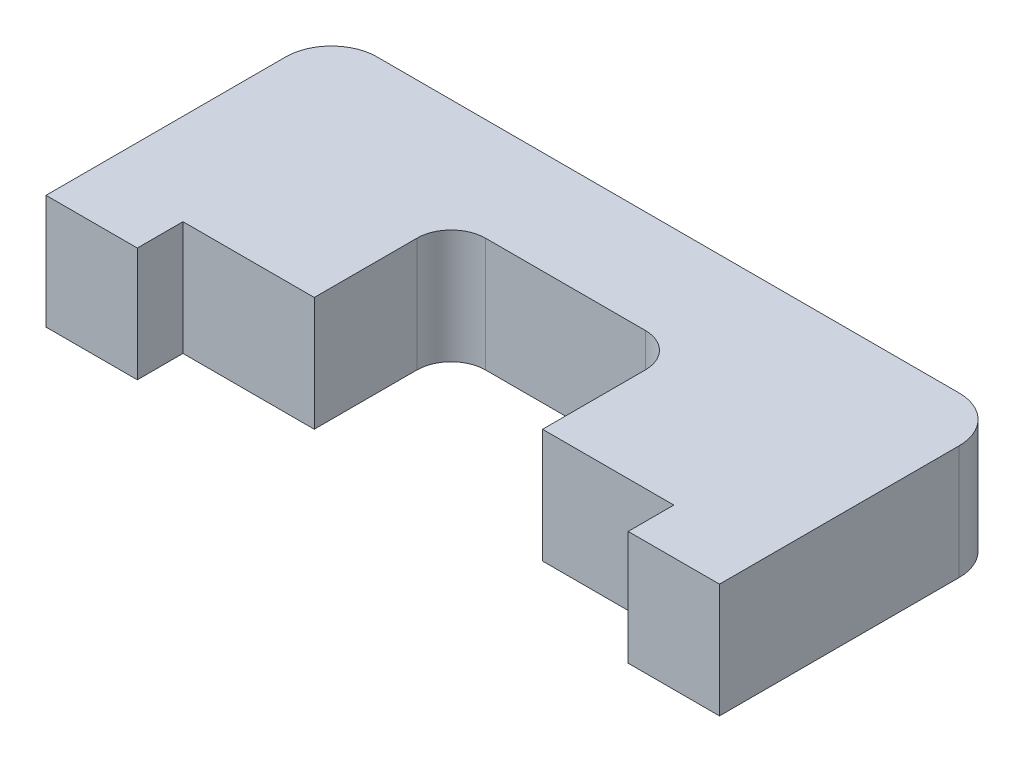
ISO-10303-21;
HEADER;
FILE_DESCRIPTION(('STEP AP214'),'2;1');
FILE_NAME('part.step','',(''),(''),'','','');
FILE_SCHEMA(('AUTOMOTIVE_DESIGN { 1 0 10303 214 1 1 1 1 }'));
ENDSEC;
DATA;
#1=APPLICATION_CONTEXT('core data for automotive mechanical design processes');
#2=APPLICATION_PROTOCOL_DEFINITION('international standard','automotive_design',2000,#1);
#3=PRODUCT_CONTEXT('',#1,'mechanical');
#4=PRODUCT('Part','Part','',(#3));
#5=PRODUCT_RELATED_PRODUCT_CATEGORY('part','',(#4));
#6=PRODUCT_DEFINITION_FORMATION('','',#4);
#7=PRODUCT_DEFINITION_CONTEXT('part definition',#1,'design');
#8=PRODUCT_DEFINITION('design','',#6,#7);
#9=PRODUCT_DEFINITION_SHAPE('','',#8);
#10=(LENGTH_UNIT() NAMED_UNIT(*) SI_UNIT(.MILLI.,.METRE.));
#11=(NAMED_UNIT(*) PLANE_ANGLE_UNIT() SI_UNIT($,.RADIAN.));
#12=(NAMED_UNIT(*) SI_UNIT($,.STERADIAN.) SOLID_ANGLE_UNIT());
#13=UNCERTAINTY_MEASURE_WITH_UNIT(LENGTH_MEASURE(1.E-05),#10,'distance_accuracy_value','');
#14=(GEOMETRIC_REPRESENTATION_CONTEXT(3) GLOBAL_UNCERTAINTY_ASSIGNED_CONTEXT((#13)) GLOBAL_UNIT_ASSIGNED_CONTEXT((#10,
#11,#12)) REPRESENTATION_CONTEXT('',''));
#15=CARTESIAN_POINT('',(0.,0.,0.));
#16=DIRECTION('',(0.,0.,1.));
#17=DIRECTION('',(1.,0.,0.));
#18=AXIS2_PLACEMENT_3D('',#15,#16,#17);
#19=CARTESIAN_POINT('',(14.75,5.,6.25));
#20=DIRECTION('',(0.,0.,-1.));
#21=DIRECTION('',(-1.,0.,0.));
#22=AXIS2_PLACEMENT_3D('',#19,#20,#21);
#23=PLANE('',#22);
#24=DIRECTION('',(1.,0.,0.));
#25=VECTOR('',#24,1.);
#26=CARTESIAN_POINT('',(14.75,0.,6.25));
#27=LINE('',#26,#25);
#28=CARTESIAN_POINT('',(-14.75,0.,6.25));
#29=VERTEX_POINT('',#28);
#30=CARTESIAN_POINT('',(-10.75,0.,6.25));
#31=VERTEX_POINT('',#30);
#32=EDGE_CURVE('E232',#29,#31,#27,.T.);
#33=ORIENTED_EDGE('',*,*,#32,.T.);
#34=DIRECTION('',(0.,-1.,0.));
#35=VECTOR('',#34,1.);
#36=CARTESIAN_POINT('',(-10.75,5.,6.25));
#37=LINE('',#36,#35);
#38=CARTESIAN_POINT('',(-10.75,5.,6.25));
#39=VERTEX_POINT('',#38);
#40=EDGE_CURVE('E332',#39,#31,#37,.T.);
#41=ORIENTED_EDGE('',*,*,#40,.F.);
#42=DIRECTION('',(1.,0.,0.));
#43=VECTOR('',#42,1.);
#44=CARTESIAN_POINT('',(14.75,5.,6.25));
#45=LINE('',#44,#43);
#46=CARTESIAN_POINT('',(-14.75,5.,6.25));
#47=VERTEX_POINT('',#46);
#48=EDGE_CURVE('E177',#47,#39,#45,.T.);
#49=ORIENTED_EDGE('',*,*,#48,.F.);
#50=DIRECTION('',(0.,-1.,0.));
#51=VECTOR('',#50,1.);
#52=CARTESIAN_POINT('',(-14.75,5.,6.25));
#53=LINE('',#52,#51);
#54=EDGE_CURVE('E246',#47,#29,#53,.T.);
#55=ORIENTED_EDGE('',*,*,#54,.T.);
#56=EDGE_LOOP('',(#33,#41,#49,#55));
#57=FACE_BOUND('',#56,.T.);
#58=ADVANCED_FACE('F39',(#57),#23,.F.);
#59=CARTESIAN_POINT('',(-14.75,5.,6.25));
#60=DIRECTION('',(1.,0.,0.));
#61=DIRECTION('',(0.,0.,-1.));
#62=AXIS2_PLACEMENT_3D('',#59,#60,#61);
#63=PLANE('',#62);
#64=DIRECTION('',(0.,0.,1.));
#65=VECTOR('',#64,1.);
#66=CARTESIAN_POINT('',(-14.75,5.,6.25));
#67=LINE('',#66,#65);
#68=CARTESIAN_POINT('',(-14.75,5.,-4.25));
#69=VERTEX_POINT('',#68);
#70=EDGE_CURVE('E213',#69,#47,#67,.T.);
#71=ORIENTED_EDGE('',*,*,#70,.F.);
#72=DIRECTION('',(0.,-1.,0.));
#73=VECTOR('',#72,1.);
#74=CARTESIAN_POINT('',(-14.75,5.,-4.25));
#75=LINE('',#74,#73);
#76=CARTESIAN_POINT('',(-14.75,0.,-4.25));
#77=VERTEX_POINT('',#76);
#78=EDGE_CURVE('E272',#69,#77,#75,.T.);
#79=ORIENTED_EDGE('',*,*,#78,.T.);
#80=DIRECTION('',(0.,0.,1.));
#81=VECTOR('',#80,1.);
#82=CARTESIAN_POINT('',(-14.75,0.,6.25));
#83=LINE('',#82,#81);
#84=EDGE_CURVE('E204',#77,#29,#83,.T.);
#85=ORIENTED_EDGE('',*,*,#84,.T.);
#86=ORIENTED_EDGE('',*,*,#54,.F.);
#87=EDGE_LOOP('',(#71,#79,#85,#86));
#88=FACE_BOUND('',#87,.T.);
#89=ADVANCED_FACE('F369',(#88),#63,.F.);
#90=CARTESIAN_POINT('',(10.75,5.00000000000001,6.25));
#91=VERTEX_POINT('',#90);
#92=CARTESIAN_POINT('',(14.75,5.,6.25));
#93=VERTEX_POINT('',#92);
#94=EDGE_CURVE('E216',#91,#93,#45,.T.);
#95=ORIENTED_EDGE('',*,*,#94,.F.);
#96=DIRECTION('',(0.,1.,0.));
#97=VECTOR('',#96,1.);
#98=CARTESIAN_POINT('',(10.75,5.00000000000001,6.25));
#99=LINE('',#98,#97);
#100=CARTESIAN_POINT('',(10.75,0.,6.25));
#101=VERTEX_POINT('',#100);
#102=EDGE_CURVE('E162',#101,#91,#99,.T.);
#103=ORIENTED_EDGE('',*,*,#102,.F.);
#104=CARTESIAN_POINT('',(14.75,0.,6.25));
#105=VERTEX_POINT('',#104);
#106=EDGE_CURVE('E231',#101,#105,#27,.T.);
#107=ORIENTED_EDGE('',*,*,#106,.T.);
#108=DIRECTION('',(0.,-1.,0.));
#109=VECTOR('',#108,1.);
#110=CARTESIAN_POINT('',(14.75,5.,6.25));
#111=LINE('',#110,#109);
#112=EDGE_CURVE('E228',#93,#105,#111,.T.);
#113=ORIENTED_EDGE('',*,*,#112,.F.);
#114=EDGE_LOOP('',(#95,#103,#107,#113));
#115=FACE_BOUND('',#114,.T.);
#116=ADVANCED_FACE('F344',(#115),#23,.F.);
#117=CARTESIAN_POINT('',(14.75,5.,6.25));
#118=DIRECTION('',(-1.,0.,0.));
#119=DIRECTION('',(0.,0.,1.));
#120=AXIS2_PLACEMENT_3D('',#117,#118,#119);
#121=PLANE('',#120);
#122=DIRECTION('',(0.,0.,-1.));
#123=VECTOR('',#122,1.);
#124=CARTESIAN_POINT('',(14.75,0.,6.25));
#125=LINE('',#124,#123);
#126=CARTESIAN_POINT('',(14.75,0.,-4.25));
#127=VERTEX_POINT('',#126);
#128=EDGE_CURVE('E236',#105,#127,#125,.T.);
#129=ORIENTED_EDGE('',*,*,#128,.T.);
#130=DIRECTION('',(0.,-1.,0.));
#131=VECTOR('',#130,1.);
#132=CARTESIAN_POINT('',(14.75,5.,-4.25));
#133=LINE('',#132,#131);
#134=CARTESIAN_POINT('',(14.75,5.,-4.25));
#135=VERTEX_POINT('',#134);
#136=EDGE_CURVE('E263',#127,#135,#133,.F.);
#137=ORIENTED_EDGE('',*,*,#136,.T.);
#138=DIRECTION('',(0.,0.,-1.));
#139=VECTOR('',#138,1.);
#140=CARTESIAN_POINT('',(14.75,5.,6.25));
#141=LINE('',#140,#139);
#142=EDGE_CURVE('E220',#93,#135,#141,.T.);
#143=ORIENTED_EDGE('',*,*,#142,.F.);
#144=ORIENTED_EDGE('',*,*,#112,.T.);
#145=EDGE_LOOP('',(#129,#137,#143,#144));
#146=FACE_BOUND('',#145,.T.);
#147=ADVANCED_FACE('F352',(#146),#121,.F.);
#148=CARTESIAN_POINT('',(14.75,5.,-6.25));
#149=DIRECTION('',(0.,0.,1.));
#150=DIRECTION('',(1.,0.,0.));
#151=AXIS2_PLACEMENT_3D('',#148,#149,#150);
#152=PLANE('',#151);
#153=DIRECTION('',(-1.,0.,0.));
#154=VECTOR('',#153,1.);
#155=CARTESIAN_POINT('',(14.75,5.,-6.25));
#156=LINE('',#155,#154);
#157=CARTESIAN_POINT('',(12.75,5.,-6.25));
#158=VERTEX_POINT('',#157);
#159=CARTESIAN_POINT('',(-12.75,5.,-6.25));
#160=VERTEX_POINT('',#159);
#161=EDGE_CURVE('E224',#158,#160,#156,.T.);
#162=ORIENTED_EDGE('',*,*,#161,.F.);
#163=DIRECTION('',(0.,-1.,0.));
#164=VECTOR('',#163,1.);
#165=CARTESIAN_POINT('',(12.75,5.,-6.25));
#166=LINE('',#165,#164);
#167=CARTESIAN_POINT('',(12.75,0.,-6.25));
#168=VERTEX_POINT('',#167);
#169=EDGE_CURVE('E253',#158,#168,#166,.T.);
#170=ORIENTED_EDGE('',*,*,#169,.T.);
#171=DIRECTION('',(-1.,0.,0.));
#172=VECTOR('',#171,1.);
#173=CARTESIAN_POINT('',(14.75,0.,-6.25));
#174=LINE('',#173,#172);
#175=CARTESIAN_POINT('',(-12.75,0.,-6.25));
#176=VERTEX_POINT('',#175);
#177=EDGE_CURVE('E217',#168,#176,#174,.T.);
#178=ORIENTED_EDGE('',*,*,#177,.T.);
#179=DIRECTION('',(0.,-1.,0.));
#180=VECTOR('',#179,1.);
#181=CARTESIAN_POINT('',(-12.75,5.,-6.25));
#182=LINE('',#181,#180);
#183=EDGE_CURVE('E250',#176,#160,#182,.F.);
#184=ORIENTED_EDGE('',*,*,#183,.T.);
#185=EDGE_LOOP('',(#162,#170,#178,#184));
#186=FACE_BOUND('',#185,.T.);
#187=ADVANCED_FACE('F360',(#186),#152,.F.);
#188=CARTESIAN_POINT('',(0.,5.,0.));
#189=DIRECTION('',(0.,1.,0.));
#190=DIRECTION('',(0.,0.,1.));
#191=AXIS2_PLACEMENT_3D('',#188,#189,#190);
#192=PLANE('',#191);
#193=DIRECTION('',(0.,0.,1.));
#194=VECTOR('',#193,1.);
#195=CARTESIAN_POINT('',(10.75,5.00000000000001,4.25));
#196=LINE('',#195,#194);
#197=CARTESIAN_POINT('',(10.75,5.00000000000001,4.25));
#198=VERTEX_POINT('',#197);
#199=EDGE_CURVE('E191',#198,#91,#196,.T.);
#200=ORIENTED_EDGE('',*,*,#199,.T.);
#201=ORIENTED_EDGE('',*,*,#94,.T.);
#202=ORIENTED_EDGE('',*,*,#142,.T.);
#203=CARTESIAN_POINT('',(12.75,5.,-4.25));
#204=DIRECTION('',(0.,1.,0.));
#205=DIRECTION('',(0.,0.,1.));
#206=AXIS2_PLACEMENT_3D('',#203,#204,#205);
#207=CIRCLE('',#206,2.);
#208=EDGE_CURVE('E269',#135,#158,#207,.T.);
#209=ORIENTED_EDGE('',*,*,#208,.T.);
#210=ORIENTED_EDGE('',*,*,#161,.T.);
#211=CARTESIAN_POINT('',(-12.75,5.,-4.25));
#212=DIRECTION('',(0.,1.,0.));
#213=DIRECTION('',(0.,0.,1.));
#214=AXIS2_PLACEMENT_3D('',#211,#212,#213);
#215=CIRCLE('',#214,2.);
#216=EDGE_CURVE('E266',#160,#69,#215,.T.);
#217=ORIENTED_EDGE('',*,*,#216,.T.);
#218=ORIENTED_EDGE('',*,*,#70,.T.);
#219=ORIENTED_EDGE('',*,*,#48,.T.);
#220=DIRECTION('',(0.,0.,1.));
#221=VECTOR('',#220,1.);
#222=CARTESIAN_POINT('',(-10.75,5.,4.25));
#223=LINE('',#222,#221);
#224=CARTESIAN_POINT('',(-10.75,5.,4.25));
#225=VERTEX_POINT('',#224);
#226=EDGE_CURVE('E166',#225,#39,#223,.T.);
#227=ORIENTED_EDGE('',*,*,#226,.F.);
#228=DIRECTION('',(-1.,0.,0.));
#229=VECTOR('',#228,1.);
#230=CARTESIAN_POINT('',(-10.75,5.,4.25));
#231=LINE('',#230,#229);
#232=CARTESIAN_POINT('',(-5.,5.,4.25));
#233=VERTEX_POINT('',#232);
#234=EDGE_CURVE('E152',#233,#225,#231,.T.);
#235=ORIENTED_EDGE('',*,*,#234,.F.);
#236=DIRECTION('',(0.,0.,1.));
#237=VECTOR('',#236,1.);
#238=CARTESIAN_POINT('',(-5.,5.,6.25));
#239=LINE('',#238,#237);
#240=CARTESIAN_POINT('',(-5.,5.,-0.249999999999992));
#241=VERTEX_POINT('',#240);
#242=EDGE_CURVE('E190',#241,#233,#239,.T.);
#243=ORIENTED_EDGE('',*,*,#242,.F.);
#244=CARTESIAN_POINT('',(-3.5,5.,-0.249999999999992));
#245=DIRECTION('',(0.,1.,0.));
#246=DIRECTION('',(0.,0.,1.));
#247=AXIS2_PLACEMENT_3D('',#244,#245,#246);
#248=CIRCLE('',#247,1.5);
#249=CARTESIAN_POINT('',(-3.5,5.,-1.74999999999999));
#250=VERTEX_POINT('',#249);
#251=EDGE_CURVE('E298',#241,#250,#248,.F.);
#252=ORIENTED_EDGE('',*,*,#251,.T.);
#253=DIRECTION('',(-1.,0.,0.));
#254=VECTOR('',#253,1.);
#255=CARTESIAN_POINT('',(-5.,5.,-1.74999999999999));
#256=LINE('',#255,#254);
#257=CARTESIAN_POINT('',(3.5,5.,-1.75));
#258=VERTEX_POINT('',#257);
#259=EDGE_CURVE('E197',#258,#250,#256,.T.);
#260=ORIENTED_EDGE('',*,*,#259,.F.);
#261=CARTESIAN_POINT('',(3.5,5.,-0.249999999999995));
#262=DIRECTION('',(0.,1.,0.));
#263=DIRECTION('',(0.,0.,1.));
#264=AXIS2_PLACEMENT_3D('',#261,#262,#263);
#265=CIRCLE('',#264,1.5);
#266=CARTESIAN_POINT('',(5.,5.,-0.249999999999995));
#267=VERTEX_POINT('',#266);
#268=EDGE_CURVE('E291',#258,#267,#265,.F.);
#269=ORIENTED_EDGE('',*,*,#268,.T.);
#270=DIRECTION('',(0.,0.,-1.));
#271=VECTOR('',#270,1.);
#272=CARTESIAN_POINT('',(5.,5.,6.25));
#273=LINE('',#272,#271);
#274=CARTESIAN_POINT('',(5.,5.,4.25));
#275=VERTEX_POINT('',#274);
#276=EDGE_CURVE('E207',#275,#267,#273,.T.);
#277=ORIENTED_EDGE('',*,*,#276,.F.);
#278=EDGE_CURVE('E63',#198,#275,#231,.T.);
#279=ORIENTED_EDGE('',*,*,#278,.F.);
#280=EDGE_LOOP('',(#200,#201,#202,#209,#210,#217,#218,#219,#227,#235,#243,#252,#260,#269,#277,#279));
#281=FACE_BOUND('',#280,.T.);
#282=ADVANCED_FACE('F175',(#281),#192,.T.);
#283=CARTESIAN_POINT('',(0.,0.,0.));
#284=DIRECTION('',(0.,1.,0.));
#285=DIRECTION('',(0.,0.,1.));
#286=AXIS2_PLACEMENT_3D('',#283,#284,#285);
#287=PLANE('',#286);
#288=ORIENTED_EDGE('',*,*,#106,.F.);
#289=DIRECTION('',(0.,0.,1.));
#290=VECTOR('',#289,1.);
#291=CARTESIAN_POINT('',(10.75,0.,4.25));
#292=LINE('',#291,#290);
#293=CARTESIAN_POINT('',(10.75,0.,4.25));
#294=VERTEX_POINT('',#293);
#295=EDGE_CURVE('E183',#294,#101,#292,.T.);
#296=ORIENTED_EDGE('',*,*,#295,.F.);
#297=DIRECTION('',(1.,0.,0.));
#298=VECTOR('',#297,1.);
#299=CARTESIAN_POINT('',(-10.75,0.,4.25));
#300=LINE('',#299,#298);
#301=CARTESIAN_POINT('',(5.,0.,4.25));
#302=VERTEX_POINT('',#301);
#303=EDGE_CURVE('E171',#302,#294,#300,.T.);
#304=ORIENTED_EDGE('',*,*,#303,.F.);
#305=DIRECTION('',(0.,0.,-1.));
#306=VECTOR('',#305,1.);
#307=CARTESIAN_POINT('',(5.,0.,6.25));
#308=LINE('',#307,#306);
#309=CARTESIAN_POINT('',(5.,0.,-0.249999999999995));
#310=VERTEX_POINT('',#309);
#311=EDGE_CURVE('E196',#302,#310,#308,.T.);
#312=ORIENTED_EDGE('',*,*,#311,.T.);
#313=CARTESIAN_POINT('',(3.5,0.,-0.249999999999995));
#314=DIRECTION('',(0.,1.,0.));
#315=DIRECTION('',(0.,0.,1.));
#316=AXIS2_PLACEMENT_3D('',#313,#314,#315);
#317=CIRCLE('',#316,1.5);
#318=CARTESIAN_POINT('',(3.5,0.,-1.75));
#319=VERTEX_POINT('',#318);
#320=EDGE_CURVE('E295',#310,#319,#317,.T.);
#321=ORIENTED_EDGE('',*,*,#320,.T.);
#322=DIRECTION('',(-1.,0.,0.));
#323=VECTOR('',#322,1.);
#324=CARTESIAN_POINT('',(-5.,0.,-1.74999999999999));
#325=LINE('',#324,#323);
#326=CARTESIAN_POINT('',(-3.5,0.,-1.74999999999999));
#327=VERTEX_POINT('',#326);
#328=EDGE_CURVE('E200',#319,#327,#325,.T.);
#329=ORIENTED_EDGE('',*,*,#328,.T.);
#330=CARTESIAN_POINT('',(-3.5,0.,-0.249999999999992));
#331=DIRECTION('',(0.,1.,0.));
#332=DIRECTION('',(0.,0.,1.));
#333=AXIS2_PLACEMENT_3D('',#330,#331,#332);
#334=CIRCLE('',#333,1.5);
#335=CARTESIAN_POINT('',(-5.,0.,-0.249999999999992));
#336=VERTEX_POINT('',#335);
#337=EDGE_CURVE('E48',#327,#336,#334,.T.);
#338=ORIENTED_EDGE('',*,*,#337,.T.);
#339=DIRECTION('',(0.,0.,1.));
#340=VECTOR('',#339,1.);
#341=CARTESIAN_POINT('',(-5.,0.,6.25));
#342=LINE('',#341,#340);
#343=CARTESIAN_POINT('',(-5.,0.,4.25));
#344=VERTEX_POINT('',#343);
#345=EDGE_CURVE('E192',#336,#344,#342,.T.);
#346=ORIENTED_EDGE('',*,*,#345,.T.);
#347=CARTESIAN_POINT('',(-10.75,0.,4.25));
#348=VERTEX_POINT('',#347);
#349=EDGE_CURVE('E55',#348,#344,#300,.T.);
#350=ORIENTED_EDGE('',*,*,#349,.F.);
#351=DIRECTION('',(0.,0.,1.));
#352=VECTOR('',#351,1.);
#353=CARTESIAN_POINT('',(-10.75,0.,4.25));
#354=LINE('',#353,#352);
#355=EDGE_CURVE('E169',#348,#31,#354,.T.);
#356=ORIENTED_EDGE('',*,*,#355,.T.);
#357=ORIENTED_EDGE('',*,*,#32,.F.);
#358=ORIENTED_EDGE('',*,*,#84,.F.);
#359=CARTESIAN_POINT('',(-12.75,0.,-4.25));
#360=DIRECTION('',(0.,1.,0.));
#361=DIRECTION('',(0.,0.,1.));
#362=AXIS2_PLACEMENT_3D('',#359,#360,#361);
#363=CIRCLE('',#362,2.);
#364=EDGE_CURVE('E257',#77,#176,#363,.F.);
#365=ORIENTED_EDGE('',*,*,#364,.T.);
#366=ORIENTED_EDGE('',*,*,#177,.F.);
#367=CARTESIAN_POINT('',(12.75,0.,-4.25));
#368=DIRECTION('',(0.,1.,0.));
#369=DIRECTION('',(0.,0.,1.));
#370=AXIS2_PLACEMENT_3D('',#367,#368,#369);
#371=CIRCLE('',#370,2.);
#372=EDGE_CURVE('E260',#168,#127,#371,.F.);
#373=ORIENTED_EDGE('',*,*,#372,.T.);
#374=ORIENTED_EDGE('',*,*,#128,.F.);
#375=EDGE_LOOP('',(#288,#296,#304,#312,#321,#329,#338,#346,#350,#356,#357,#358,#365,#366,#373,#374));
#376=FACE_BOUND('',#375,.T.);
#377=ADVANCED_FACE('F305',(#376),#287,.F.);
#378=CARTESIAN_POINT('',(-5.,0.,6.25));
#379=DIRECTION('',(-1.,0.,0.));
#380=DIRECTION('',(0.,0.,1.));
#381=AXIS2_PLACEMENT_3D('',#378,#379,#380);
#382=PLANE('',#381);
#383=ORIENTED_EDGE('',*,*,#242,.T.);
#384=DIRECTION('',(0.,-1.,0.));
#385=VECTOR('',#384,1.);
#386=CARTESIAN_POINT('',(-5.,0.,4.25));
#387=LINE('',#386,#385);
#388=EDGE_CURVE('E156',#233,#344,#387,.T.);
#389=ORIENTED_EDGE('',*,*,#388,.T.);
#390=ORIENTED_EDGE('',*,*,#345,.F.);
#391=DIRECTION('',(0.,1.,0.));
#392=VECTOR('',#391,1.);
#393=CARTESIAN_POINT('',(-5.,5.,-0.249999999999992));
#394=LINE('',#393,#392);
#395=EDGE_CURVE('E287',#336,#241,#394,.T.);
#396=ORIENTED_EDGE('',*,*,#395,.T.);
#397=EDGE_LOOP('',(#383,#389,#390,#396));
#398=FACE_BOUND('',#397,.T.);
#399=ADVANCED_FACE('F311',(#398),#382,.F.);
#400=CARTESIAN_POINT('',(-5.,0.,-1.74999999999999));
#401=DIRECTION('',(0.,0.,-1.));
#402=DIRECTION('',(-1.,0.,0.));
#403=AXIS2_PLACEMENT_3D('',#400,#401,#402);
#404=PLANE('',#403);
#405=ORIENTED_EDGE('',*,*,#328,.F.);
#406=DIRECTION('',(0.,1.,0.));
#407=VECTOR('',#406,1.);
#408=CARTESIAN_POINT('',(3.5,5.,-1.75));
#409=LINE('',#408,#407);
#410=EDGE_CURVE('E279',#319,#258,#409,.T.);
#411=ORIENTED_EDGE('',*,*,#410,.T.);
#412=ORIENTED_EDGE('',*,*,#259,.T.);
#413=DIRECTION('',(0.,1.,0.));
#414=VECTOR('',#413,1.);
#415=CARTESIAN_POINT('',(-3.5,0.,-1.74999999999999));
#416=LINE('',#415,#414);
#417=EDGE_CURVE('E276',#250,#327,#416,.F.);
#418=ORIENTED_EDGE('',*,*,#417,.T.);
#419=EDGE_LOOP('',(#405,#411,#412,#418));
#420=FACE_BOUND('',#419,.T.);
#421=ADVANCED_FACE('F314',(#420),#404,.F.);
#422=CARTESIAN_POINT('',(5.,0.,6.25));
#423=DIRECTION('',(1.,0.,0.));
#424=DIRECTION('',(0.,0.,-1.));
#425=AXIS2_PLACEMENT_3D('',#422,#423,#424);
#426=PLANE('',#425);
#427=ORIENTED_EDGE('',*,*,#311,.F.);
#428=DIRECTION('',(0.,1.,0.));
#429=VECTOR('',#428,1.);
#430=CARTESIAN_POINT('',(5.,0.,4.25));
#431=LINE('',#430,#429);
#432=EDGE_CURVE('E11',#302,#275,#431,.T.);
#433=ORIENTED_EDGE('',*,*,#432,.T.);
#434=ORIENTED_EDGE('',*,*,#276,.T.);
#435=DIRECTION('',(0.,1.,0.));
#436=VECTOR('',#435,1.);
#437=CARTESIAN_POINT('',(5.,0.,-0.249999999999995));
#438=LINE('',#437,#436);
#439=EDGE_CURVE('E283',#267,#310,#438,.F.);
#440=ORIENTED_EDGE('',*,*,#439,.T.);
#441=EDGE_LOOP('',(#427,#433,#434,#440));
#442=FACE_BOUND('',#441,.T.);
#443=ADVANCED_FACE('F323',(#442),#426,.F.);
#444=CARTESIAN_POINT('',(12.75,5.,-4.25));
#445=DIRECTION('',(0.,-1.,0.));
#446=DIRECTION('',(0.,0.,-1.));
#447=AXIS2_PLACEMENT_3D('',#444,#445,#446);
#448=CYLINDRICAL_SURFACE('',#447,2.);
#449=ORIENTED_EDGE('',*,*,#208,.F.);
#450=ORIENTED_EDGE('',*,*,#136,.F.);
#451=ORIENTED_EDGE('',*,*,#372,.F.);
#452=ORIENTED_EDGE('',*,*,#169,.F.);
#453=EDGE_LOOP('',(#449,#450,#451,#452));
#454=FACE_BOUND('',#453,.T.);
#455=ADVANCED_FACE('F355',(#454),#448,.T.);
#456=CARTESIAN_POINT('',(-12.75,5.,-4.25));
#457=DIRECTION('',(0.,-1.,0.));
#458=DIRECTION('',(0.,0.,-1.));
#459=AXIS2_PLACEMENT_3D('',#456,#457,#458);
#460=CYLINDRICAL_SURFACE('',#459,2.);
#461=ORIENTED_EDGE('',*,*,#216,.F.);
#462=ORIENTED_EDGE('',*,*,#183,.F.);
#463=ORIENTED_EDGE('',*,*,#364,.F.);
#464=ORIENTED_EDGE('',*,*,#78,.F.);
#465=EDGE_LOOP('',(#461,#462,#463,#464));
#466=FACE_BOUND('',#465,.T.);
#467=ADVANCED_FACE('F364',(#466),#460,.T.);
#468=CARTESIAN_POINT('',(3.5,0.,-0.249999999999995));
#469=DIRECTION('',(0.,-1.,0.));
#470=DIRECTION('',(0.,0.,-1.));
#471=AXIS2_PLACEMENT_3D('',#468,#469,#470);
#472=CYLINDRICAL_SURFACE('',#471,1.5);
#473=ORIENTED_EDGE('',*,*,#320,.F.);
#474=ORIENTED_EDGE('',*,*,#439,.F.);
#475=ORIENTED_EDGE('',*,*,#268,.F.);
#476=ORIENTED_EDGE('',*,*,#410,.F.);
#477=EDGE_LOOP('',(#473,#474,#475,#476));
#478=FACE_BOUND('',#477,.T.);
#479=ADVANCED_FACE('F318',(#478),#472,.F.);
#480=CARTESIAN_POINT('',(-3.5,0.,-0.249999999999992));
#481=DIRECTION('',(0.,-1.,0.));
#482=DIRECTION('',(0.,0.,-1.));
#483=AXIS2_PLACEMENT_3D('',#480,#481,#482);
#484=CYLINDRICAL_SURFACE('',#483,1.5);
#485=ORIENTED_EDGE('',*,*,#337,.F.);
#486=ORIENTED_EDGE('',*,*,#417,.F.);
#487=ORIENTED_EDGE('',*,*,#251,.F.);
#488=ORIENTED_EDGE('',*,*,#395,.F.);
#489=EDGE_LOOP('',(#485,#486,#487,#488));
#490=FACE_BOUND('',#489,.T.);
#491=ADVANCED_FACE('F41',(#490),#484,.F.);
#492=CARTESIAN_POINT('',(0.,0.,4.25));
#493=DIRECTION('',(0.,0.,-1.));
#494=DIRECTION('',(-1.,0.,0.));
#495=AXIS2_PLACEMENT_3D('',#492,#493,#494);
#496=PLANE('',#495);
#497=ORIENTED_EDGE('',*,*,#303,.T.);
#498=DIRECTION('',(0.,1.,0.));
#499=VECTOR('',#498,1.);
#500=CARTESIAN_POINT('',(10.75,5.00000000000001,4.25));
#501=LINE('',#500,#499);
#502=EDGE_CURVE('E179',#294,#198,#501,.T.);
#503=ORIENTED_EDGE('',*,*,#502,.T.);
#504=ORIENTED_EDGE('',*,*,#278,.T.);
#505=ORIENTED_EDGE('',*,*,#432,.F.);
#506=EDGE_LOOP('',(#497,#503,#504,#505));
#507=FACE_BOUND('',#506,.T.);
#508=ADVANCED_FACE('F325',(#507),#496,.F.);
#509=CARTESIAN_POINT('',(10.75,5.00000000000001,4.25));
#510=DIRECTION('',(1.,0.,0.));
#511=DIRECTION('',(0.,0.,-1.));
#512=AXIS2_PLACEMENT_3D('',#509,#510,#511);
#513=PLANE('',#512);
#514=ORIENTED_EDGE('',*,*,#102,.T.);
#515=ORIENTED_EDGE('',*,*,#199,.F.);
#516=ORIENTED_EDGE('',*,*,#502,.F.);
#517=ORIENTED_EDGE('',*,*,#295,.T.);
#518=EDGE_LOOP('',(#514,#515,#516,#517));
#519=FACE_BOUND('',#518,.T.);
#520=ADVANCED_FACE('F341',(#519),#513,.F.);
#521=ORIENTED_EDGE('',*,*,#234,.T.);
#522=DIRECTION('',(0.,-1.,0.));
#523=VECTOR('',#522,1.);
#524=CARTESIAN_POINT('',(-10.75,5.,4.25));
#525=LINE('',#524,#523);
#526=EDGE_CURVE('E155',#225,#348,#525,.T.);
#527=ORIENTED_EDGE('',*,*,#526,.T.);
#528=ORIENTED_EDGE('',*,*,#349,.T.);
#529=ORIENTED_EDGE('',*,*,#388,.F.);
#530=EDGE_LOOP('',(#521,#527,#528,#529));
#531=FACE_BOUND('',#530,.T.);
#532=ADVANCED_FACE('F154',(#531),#496,.F.);
#533=CARTESIAN_POINT('',(-10.75,5.,4.25));
#534=DIRECTION('',(-1.,0.,0.));
#535=DIRECTION('',(0.,0.,1.));
#536=AXIS2_PLACEMENT_3D('',#533,#534,#535);
#537=PLANE('',#536);
#538=ORIENTED_EDGE('',*,*,#40,.T.);
#539=ORIENTED_EDGE('',*,*,#355,.F.);
#540=ORIENTED_EDGE('',*,*,#526,.F.);
#541=ORIENTED_EDGE('',*,*,#226,.T.);
#542=EDGE_LOOP('',(#538,#539,#540,#541));
#543=FACE_BOUND('',#542,.T.);
#544=ADVANCED_FACE('F165',(#543),#537,.F.);
#545=CLOSED_SHELL('',(#58,#89,#116,#147,#187,#282,#377,#399,#421,#443,#455,#467,#479,#491,#508,
#520,#532,#544));
#546=MANIFOLD_SOLID_BREP('B2',#545);
#547=ADVANCED_BREP_SHAPE_REPRESENTATION('',(#18,#546),#14);
#548=SHAPE_DEFINITION_REPRESENTATION(#9,#547);
ENDSEC;
END-ISO-10303-21;
